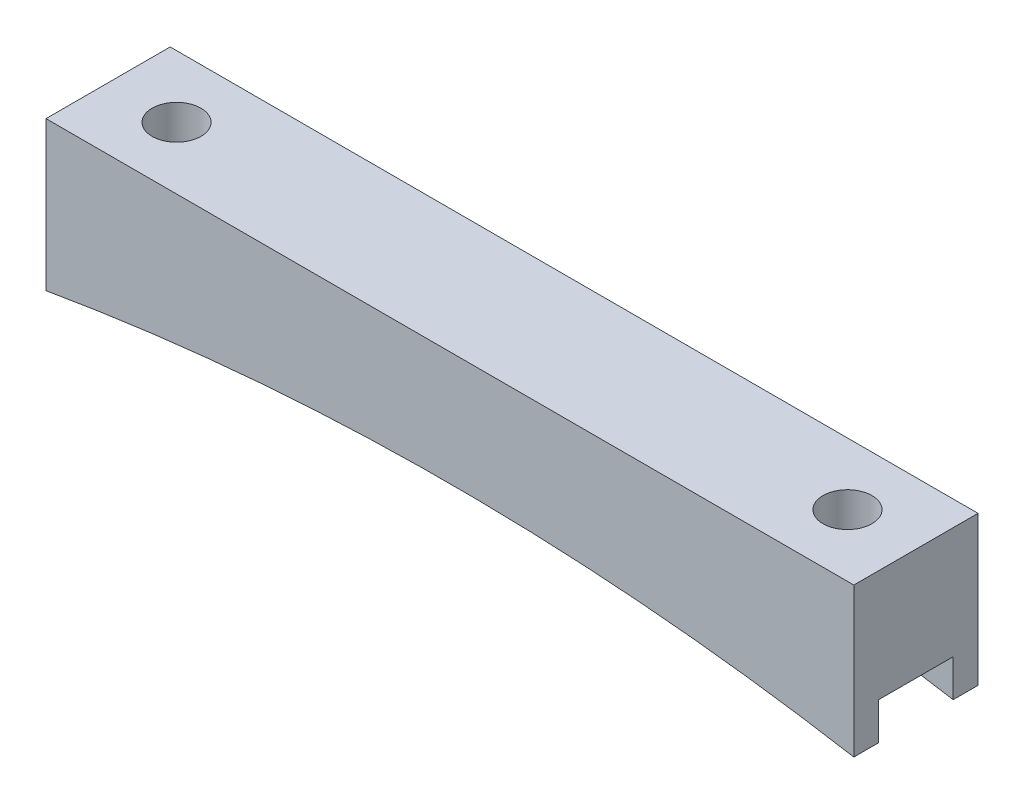
ISO-10303-21;
HEADER;
FILE_DESCRIPTION(('STEP AP214'),'2;1');
FILE_NAME('part.step','',(''),(''),'','','');
FILE_SCHEMA(('AUTOMOTIVE_DESIGN { 1 0 10303 214 1 1 1 1 }'));
ENDSEC;
DATA;
#1=APPLICATION_CONTEXT('core data for automotive mechanical design processes');
#2=APPLICATION_PROTOCOL_DEFINITION('international standard','automotive_design',2000,#1);
#3=PRODUCT_CONTEXT('',#1,'mechanical');
#4=PRODUCT('Part','Part','',(#3));
#5=PRODUCT_RELATED_PRODUCT_CATEGORY('part','',(#4));
#6=PRODUCT_DEFINITION_FORMATION('','',#4);
#7=PRODUCT_DEFINITION_CONTEXT('part definition',#1,'design');
#8=PRODUCT_DEFINITION('design','',#6,#7);
#9=PRODUCT_DEFINITION_SHAPE('','',#8);
#10=(LENGTH_UNIT() NAMED_UNIT(*) SI_UNIT(.MILLI.,.METRE.));
#11=(NAMED_UNIT(*) PLANE_ANGLE_UNIT() SI_UNIT($,.RADIAN.));
#12=(NAMED_UNIT(*) SI_UNIT($,.STERADIAN.) SOLID_ANGLE_UNIT());
#13=UNCERTAINTY_MEASURE_WITH_UNIT(LENGTH_MEASURE(1.E-05),#10,'distance_accuracy_value','');
#14=(GEOMETRIC_REPRESENTATION_CONTEXT(3) GLOBAL_UNCERTAINTY_ASSIGNED_CONTEXT((#13)) GLOBAL_UNIT_ASSIGNED_CONTEXT((#10,
#11,#12)) REPRESENTATION_CONTEXT('',''));
#15=CARTESIAN_POINT('',(0.,0.,0.));
#16=DIRECTION('',(0.,0.,1.));
#17=DIRECTION('',(1.,0.,0.));
#18=AXIS2_PLACEMENT_3D('',#15,#16,#17);
#19=CARTESIAN_POINT('',(0.,-252.977615660627,12.7));
#20=DIRECTION('',(0.,0.,-1.));
#21=DIRECTION('',(-1.,0.,0.));
#22=AXIS2_PLACEMENT_3D('',#19,#20,#21);
#23=CYLINDRICAL_SURFACE('',#22,241.3);
#24=DIRECTION('',(0.,0.,-1.));
#25=VECTOR('',#24,1.);
#26=CARTESIAN_POINT('',(-41.31,-15.24,12.7));
#27=LINE('',#26,#25);
#28=CARTESIAN_POINT('',(-41.31,-15.24,12.7));
#29=VERTEX_POINT('',#28);
#30=CARTESIAN_POINT('',(-41.31,-15.24,10.16));
#31=VERTEX_POINT('',#30);
#32=EDGE_CURVE('E132',#29,#31,#27,.T.);
#33=ORIENTED_EDGE('',*,*,#32,.T.);
#34=CARTESIAN_POINT('',(0.,-252.977615660627,10.16));
#35=DIRECTION('',(0.,0.,1.));
#36=DIRECTION('',(1.,0.,0.));
#37=AXIS2_PLACEMENT_3D('',#34,#35,#36);
#38=CIRCLE('',#37,241.3);
#39=CARTESIAN_POINT('',(41.31,-15.24,10.16));
#40=VERTEX_POINT('',#39);
#41=EDGE_CURVE('E11',#31,#40,#38,.F.);
#42=ORIENTED_EDGE('',*,*,#41,.T.);
#43=DIRECTION('',(0.,0.,-1.));
#44=VECTOR('',#43,1.);
#45=CARTESIAN_POINT('',(41.31,-15.24,12.7));
#46=LINE('',#45,#44);
#47=CARTESIAN_POINT('',(41.31,-15.24,12.7));
#48=VERTEX_POINT('',#47);
#49=EDGE_CURVE('E147',#48,#40,#46,.T.);
#50=ORIENTED_EDGE('',*,*,#49,.F.);
#51=CARTESIAN_POINT('',(0.,-252.977615660627,12.7));
#52=DIRECTION('',(0.,0.,-1.));
#53=DIRECTION('',(-1.,0.,0.));
#54=AXIS2_PLACEMENT_3D('',#51,#52,#53);
#55=CIRCLE('',#54,241.3);
#56=EDGE_CURVE('E68',#29,#48,#55,.T.);
#57=ORIENTED_EDGE('',*,*,#56,.F.);
#58=EDGE_LOOP('',(#33,#42,#50,#57));
#59=FACE_BOUND('',#58,.T.);
#60=ADVANCED_FACE('F43',(#59),#23,.F.);
#61=CARTESIAN_POINT('',(41.31,0.,12.7));
#62=DIRECTION('',(-1.,0.,0.));
#63=DIRECTION('',(0.,0.,1.));
#64=AXIS2_PLACEMENT_3D('',#61,#62,#63);
#65=PLANE('',#64);
#66=ORIENTED_EDGE('',*,*,#49,.T.);
#67=DIRECTION('',(0.,-1.,0.));
#68=VECTOR('',#67,1.);
#69=CARTESIAN_POINT('',(41.31,-15.24,10.16));
#70=LINE('',#69,#68);
#71=CARTESIAN_POINT('',(41.31,-11.43,10.16));
#72=VERTEX_POINT('',#71);
#73=EDGE_CURVE('E124',#72,#40,#70,.T.);
#74=ORIENTED_EDGE('',*,*,#73,.F.);
#75=DIRECTION('',(0.,0.,1.));
#76=VECTOR('',#75,1.);
#77=CARTESIAN_POINT('',(41.31,-11.43,10.16));
#78=LINE('',#77,#76);
#79=CARTESIAN_POINT('',(41.31,-11.43,2.54));
#80=VERTEX_POINT('',#79);
#81=EDGE_CURVE('E136',#80,#72,#78,.T.);
#82=ORIENTED_EDGE('',*,*,#81,.F.);
#83=DIRECTION('',(0.,1.,0.));
#84=VECTOR('',#83,1.);
#85=CARTESIAN_POINT('',(41.31,-15.24,2.54));
#86=LINE('',#85,#84);
#87=CARTESIAN_POINT('',(41.31,-15.24,2.54));
#88=VERTEX_POINT('',#87);
#89=EDGE_CURVE('E210',#88,#80,#86,.T.);
#90=ORIENTED_EDGE('',*,*,#89,.F.);
#91=CARTESIAN_POINT('',(41.31,-15.24,0.));
#92=VERTEX_POINT('',#91);
#93=EDGE_CURVE('E90',#88,#92,#46,.T.);
#94=ORIENTED_EDGE('',*,*,#93,.T.);
#95=DIRECTION('',(0.,1.,0.));
#96=VECTOR('',#95,1.);
#97=CARTESIAN_POINT('',(41.31,0.,0.));
#98=LINE('',#97,#96);
#99=CARTESIAN_POINT('',(41.31,0.,0.));
#100=VERTEX_POINT('',#99);
#101=EDGE_CURVE('E174',#92,#100,#98,.T.);
#102=ORIENTED_EDGE('',*,*,#101,.T.);
#103=DIRECTION('',(0.,0.,-1.));
#104=VECTOR('',#103,1.);
#105=CARTESIAN_POINT('',(41.31,0.,12.7));
#106=LINE('',#105,#104);
#107=CARTESIAN_POINT('',(41.31,0.,12.7));
#108=VERTEX_POINT('',#107);
#109=EDGE_CURVE('E145',#108,#100,#106,.T.);
#110=ORIENTED_EDGE('',*,*,#109,.F.);
#111=DIRECTION('',(0.,1.,0.));
#112=VECTOR('',#111,1.);
#113=CARTESIAN_POINT('',(41.31,0.,12.7));
#114=LINE('',#113,#112);
#115=EDGE_CURVE('E176',#48,#108,#114,.T.);
#116=ORIENTED_EDGE('',*,*,#115,.F.);
#117=EDGE_LOOP('',(#66,#74,#82,#90,#94,#102,#110,#116));
#118=FACE_BOUND('',#117,.T.);
#119=ADVANCED_FACE('F45',(#118),#65,.F.);
#120=CARTESIAN_POINT('',(-41.31,0.,12.7));
#121=DIRECTION('',(0.,-1.,0.));
#122=DIRECTION('',(1.,0.,0.));
#123=AXIS2_PLACEMENT_3D('',#120,#121,#122);
#124=PLANE('',#123);
#125=CARTESIAN_POINT('',(-34.31,0.,6.35));
#126=DIRECTION('',(0.,1.,0.));
#127=DIRECTION('',(-1.,0.,0.));
#128=AXIS2_PLACEMENT_3D('',#125,#126,#127);
#129=CIRCLE('',#128,2.49999999999999);
#130=CARTESIAN_POINT('',(-36.81,0.,6.35));
#131=VERTEX_POINT('',#130);
#132=EDGE_CURVE('E184',#131,#131,#129,.T.);
#133=ORIENTED_EDGE('',*,*,#132,.F.);
#134=EDGE_LOOP('',(#133));
#135=FACE_BOUND('',#134,.T.);
#136=CARTESIAN_POINT('',(34.31,0.,6.35));
#137=DIRECTION('',(0.,1.,0.));
#138=DIRECTION('',(-1.,0.,0.));
#139=AXIS2_PLACEMENT_3D('',#136,#137,#138);
#140=CIRCLE('',#139,2.5);
#141=CARTESIAN_POINT('',(31.81,0.,6.35));
#142=VERTEX_POINT('',#141);
#143=EDGE_CURVE('E192',#142,#142,#140,.T.);
#144=ORIENTED_EDGE('',*,*,#143,.F.);
#145=EDGE_LOOP('',(#144));
#146=FACE_BOUND('',#145,.T.);
#147=DIRECTION('',(-1.,0.,0.));
#148=VECTOR('',#147,1.);
#149=CARTESIAN_POINT('',(-41.31,0.,0.));
#150=LINE('',#149,#148);
#151=CARTESIAN_POINT('',(-41.31,0.,0.));
#152=VERTEX_POINT('',#151);
#153=EDGE_CURVE('E170',#100,#152,#150,.T.);
#154=ORIENTED_EDGE('',*,*,#153,.T.);
#155=DIRECTION('',(0.,0.,-1.));
#156=VECTOR('',#155,1.);
#157=CARTESIAN_POINT('',(-41.31,0.,12.7));
#158=LINE('',#157,#156);
#159=CARTESIAN_POINT('',(-41.31,0.,12.7));
#160=VERTEX_POINT('',#159);
#161=EDGE_CURVE('E139',#160,#152,#158,.T.);
#162=ORIENTED_EDGE('',*,*,#161,.F.);
#163=DIRECTION('',(-1.,0.,0.));
#164=VECTOR('',#163,1.);
#165=CARTESIAN_POINT('',(-41.31,0.,12.7));
#166=LINE('',#165,#164);
#167=EDGE_CURVE('E98',#108,#160,#166,.T.);
#168=ORIENTED_EDGE('',*,*,#167,.F.);
#169=ORIENTED_EDGE('',*,*,#109,.T.);
#170=EDGE_LOOP('',(#154,#162,#168,#169));
#171=FACE_BOUND('',#170,.T.);
#172=ADVANCED_FACE('F235',(#135,#146,#171),#124,.F.);
#173=CARTESIAN_POINT('',(-41.31,0.,12.7));
#174=DIRECTION('',(1.,0.,0.));
#175=DIRECTION('',(0.,0.,-1.));
#176=AXIS2_PLACEMENT_3D('',#173,#174,#175);
#177=PLANE('',#176);
#178=DIRECTION('',(0.,0.,1.));
#179=VECTOR('',#178,1.);
#180=CARTESIAN_POINT('',(-41.31,-11.43,10.16));
#181=LINE('',#180,#179);
#182=CARTESIAN_POINT('',(-41.31,-11.43,2.54));
#183=VERTEX_POINT('',#182);
#184=CARTESIAN_POINT('',(-41.31,-11.43,10.16));
#185=VERTEX_POINT('',#184);
#186=EDGE_CURVE('E134',#183,#185,#181,.T.);
#187=ORIENTED_EDGE('',*,*,#186,.T.);
#188=DIRECTION('',(0.,-1.,0.));
#189=VECTOR('',#188,1.);
#190=CARTESIAN_POINT('',(-41.31,-15.24,10.16));
#191=LINE('',#190,#189);
#192=EDGE_CURVE('E121',#185,#31,#191,.T.);
#193=ORIENTED_EDGE('',*,*,#192,.T.);
#194=ORIENTED_EDGE('',*,*,#32,.F.);
#195=DIRECTION('',(0.,-1.,0.));
#196=VECTOR('',#195,1.);
#197=CARTESIAN_POINT('',(-41.31,0.,12.7));
#198=LINE('',#197,#196);
#199=EDGE_CURVE('E187',#160,#29,#198,.T.);
#200=ORIENTED_EDGE('',*,*,#199,.F.);
#201=ORIENTED_EDGE('',*,*,#161,.T.);
#202=DIRECTION('',(0.,-1.,0.));
#203=VECTOR('',#202,1.);
#204=CARTESIAN_POINT('',(-41.31,0.,0.));
#205=LINE('',#204,#203);
#206=CARTESIAN_POINT('',(-41.31,-15.24,0.));
#207=VERTEX_POINT('',#206);
#208=EDGE_CURVE('E165',#152,#207,#205,.T.);
#209=ORIENTED_EDGE('',*,*,#208,.T.);
#210=CARTESIAN_POINT('',(-41.31,-15.24,2.54));
#211=VERTEX_POINT('',#210);
#212=EDGE_CURVE('E140',#211,#207,#27,.T.);
#213=ORIENTED_EDGE('',*,*,#212,.F.);
#214=DIRECTION('',(0.,1.,0.));
#215=VECTOR('',#214,1.);
#216=CARTESIAN_POINT('',(-41.31,-15.24,2.54));
#217=LINE('',#216,#215);
#218=EDGE_CURVE('E59',#211,#183,#217,.T.);
#219=ORIENTED_EDGE('',*,*,#218,.T.);
#220=EDGE_LOOP('',(#187,#193,#194,#200,#201,#209,#213,#219));
#221=FACE_BOUND('',#220,.T.);
#222=ADVANCED_FACE('F130',(#221),#177,.F.);
#223=ORIENTED_EDGE('',*,*,#93,.F.);
#224=CARTESIAN_POINT('',(0.,-252.977615660627,2.54));
#225=DIRECTION('',(0.,0.,-1.));
#226=DIRECTION('',(-1.,0.,0.));
#227=AXIS2_PLACEMENT_3D('',#224,#225,#226);
#228=CIRCLE('',#227,241.3);
#229=EDGE_CURVE('E52',#88,#211,#228,.F.);
#230=ORIENTED_EDGE('',*,*,#229,.T.);
#231=ORIENTED_EDGE('',*,*,#212,.T.);
#232=CARTESIAN_POINT('',(0.,-252.977615660627,0.));
#233=DIRECTION('',(0.,0.,-1.));
#234=DIRECTION('',(-1.,0.,0.));
#235=AXIS2_PLACEMENT_3D('',#232,#233,#234);
#236=CIRCLE('',#235,241.3);
#237=EDGE_CURVE('E169',#207,#92,#236,.T.);
#238=ORIENTED_EDGE('',*,*,#237,.T.);
#239=EDGE_LOOP('',(#223,#230,#231,#238));
#240=FACE_BOUND('',#239,.T.);
#241=ADVANCED_FACE('F161',(#240),#23,.F.);
#242=CARTESIAN_POINT('',(0.,-252.977615660627,12.7));
#243=DIRECTION('',(0.,0.,-1.));
#244=DIRECTION('',(-1.,0.,0.));
#245=AXIS2_PLACEMENT_3D('',#242,#243,#244);
#246=PLANE('',#245);
#247=ORIENTED_EDGE('',*,*,#115,.T.);
#248=ORIENTED_EDGE('',*,*,#167,.T.);
#249=ORIENTED_EDGE('',*,*,#199,.T.);
#250=ORIENTED_EDGE('',*,*,#56,.T.);
#251=EDGE_LOOP('',(#247,#248,#249,#250));
#252=FACE_BOUND('',#251,.T.);
#253=ADVANCED_FACE('F240',(#252),#246,.F.);
#254=CARTESIAN_POINT('',(0.,-252.977615660627,0.));
#255=DIRECTION('',(0.,0.,-1.));
#256=DIRECTION('',(-1.,0.,0.));
#257=AXIS2_PLACEMENT_3D('',#254,#255,#256);
#258=PLANE('',#257);
#259=ORIENTED_EDGE('',*,*,#101,.F.);
#260=ORIENTED_EDGE('',*,*,#237,.F.);
#261=ORIENTED_EDGE('',*,*,#208,.F.);
#262=ORIENTED_EDGE('',*,*,#153,.F.);
#263=EDGE_LOOP('',(#259,#260,#261,#262));
#264=FACE_BOUND('',#263,.T.);
#265=ADVANCED_FACE('F173',(#264),#258,.T.);
#266=CARTESIAN_POINT('',(34.31,-15.24,6.35));
#267=DIRECTION('',(0.,1.,0.));
#268=DIRECTION('',(-1.,0.,0.));
#269=AXIS2_PLACEMENT_3D('',#266,#267,#268);
#270=CYLINDRICAL_SURFACE('',#269,2.5);
#271=CARTESIAN_POINT('',(34.31,-11.43,6.35));
#272=DIRECTION('',(0.,1.,0.));
#273=DIRECTION('',(0.,0.,1.));
#274=AXIS2_PLACEMENT_3D('',#271,#272,#273);
#275=CIRCLE('',#274,2.5);
#276=CARTESIAN_POINT('',(34.31,-11.43,8.85));
#277=VERTEX_POINT('',#276);
#278=EDGE_CURVE('E156',#277,#277,#275,.F.);
#279=ORIENTED_EDGE('',*,*,#278,.T.);
#280=EDGE_LOOP('',(#279));
#281=FACE_BOUND('',#280,.T.);
#282=ORIENTED_EDGE('',*,*,#143,.T.);
#283=EDGE_LOOP('',(#282));
#284=FACE_BOUND('',#283,.T.);
#285=ADVANCED_FACE('F228',(#281,#284),#270,.F.);
#286=CARTESIAN_POINT('',(-34.31,-15.24,6.35));
#287=DIRECTION('',(0.,1.,0.));
#288=DIRECTION('',(-1.,0.,0.));
#289=AXIS2_PLACEMENT_3D('',#286,#287,#288);
#290=CYLINDRICAL_SURFACE('',#289,2.49999999999999);
#291=CARTESIAN_POINT('',(-34.31,-11.43,6.35));
#292=DIRECTION('',(0.,1.,0.));
#293=DIRECTION('',(0.,0.,1.));
#294=AXIS2_PLACEMENT_3D('',#291,#292,#293);
#295=CIRCLE('',#294,2.49999999999999);
#296=CARTESIAN_POINT('',(-34.31,-11.43,8.84999999999999));
#297=VERTEX_POINT('',#296);
#298=EDGE_CURVE('E153',#297,#297,#295,.F.);
#299=ORIENTED_EDGE('',*,*,#298,.T.);
#300=EDGE_LOOP('',(#299));
#301=FACE_BOUND('',#300,.T.);
#302=ORIENTED_EDGE('',*,*,#132,.T.);
#303=EDGE_LOOP('',(#302));
#304=FACE_BOUND('',#303,.T.);
#305=ADVANCED_FACE('F231',(#301,#304),#290,.F.);
#306=CARTESIAN_POINT('',(-41.31,-15.24,10.16));
#307=DIRECTION('',(0.,0.,1.));
#308=DIRECTION('',(1.,0.,0.));
#309=AXIS2_PLACEMENT_3D('',#306,#307,#308);
#310=PLANE('',#309);
#311=ORIENTED_EDGE('',*,*,#192,.F.);
#312=DIRECTION('',(1.,0.,0.));
#313=VECTOR('',#312,1.);
#314=CARTESIAN_POINT('',(-41.31,-11.43,10.16));
#315=LINE('',#314,#313);
#316=EDGE_CURVE('E157',#185,#72,#315,.T.);
#317=ORIENTED_EDGE('',*,*,#316,.T.);
#318=ORIENTED_EDGE('',*,*,#73,.T.);
#319=ORIENTED_EDGE('',*,*,#41,.F.);
#320=EDGE_LOOP('',(#311,#317,#318,#319));
#321=FACE_BOUND('',#320,.T.);
#322=ADVANCED_FACE('F120',(#321),#310,.F.);
#323=CARTESIAN_POINT('',(-41.31,-15.24,2.54));
#324=DIRECTION('',(0.,0.,-1.));
#325=DIRECTION('',(-1.,0.,0.));
#326=AXIS2_PLACEMENT_3D('',#323,#324,#325);
#327=PLANE('',#326);
#328=ORIENTED_EDGE('',*,*,#89,.T.);
#329=DIRECTION('',(1.,0.,0.));
#330=VECTOR('',#329,1.);
#331=CARTESIAN_POINT('',(-41.31,-11.43,2.54));
#332=LINE('',#331,#330);
#333=EDGE_CURVE('E202',#183,#80,#332,.T.);
#334=ORIENTED_EDGE('',*,*,#333,.F.);
#335=ORIENTED_EDGE('',*,*,#218,.F.);
#336=ORIENTED_EDGE('',*,*,#229,.F.);
#337=EDGE_LOOP('',(#328,#334,#335,#336));
#338=FACE_BOUND('',#337,.T.);
#339=ADVANCED_FACE('F219',(#338),#327,.F.);
#340=CARTESIAN_POINT('',(-41.31,-11.43,10.16));
#341=DIRECTION('',(0.,1.,0.));
#342=DIRECTION('',(0.,0.,1.));
#343=AXIS2_PLACEMENT_3D('',#340,#341,#342);
#344=PLANE('',#343);
#345=ORIENTED_EDGE('',*,*,#298,.F.);
#346=EDGE_LOOP('',(#345));
#347=FACE_BOUND('',#346,.T.);
#348=ORIENTED_EDGE('',*,*,#81,.T.);
#349=ORIENTED_EDGE('',*,*,#316,.F.);
#350=ORIENTED_EDGE('',*,*,#186,.F.);
#351=ORIENTED_EDGE('',*,*,#333,.T.);
#352=EDGE_LOOP('',(#348,#349,#350,#351));
#353=FACE_BOUND('',#352,.T.);
#354=ORIENTED_EDGE('',*,*,#278,.F.);
#355=EDGE_LOOP('',(#354));
#356=FACE_BOUND('',#355,.T.);
#357=ADVANCED_FACE('F221',(#347,#353,#356),#344,.F.);
#358=CLOSED_SHELL('',(#60,#119,#172,#222,#241,#253,#265,#285,#305,#322,#339,#357));
#359=MANIFOLD_SOLID_BREP('B2',#358);
#360=ADVANCED_BREP_SHAPE_REPRESENTATION('',(#18,#359),#14);
#361=SHAPE_DEFINITION_REPRESENTATION(#9,#360);
ENDSEC;
END-ISO-10303-21;
